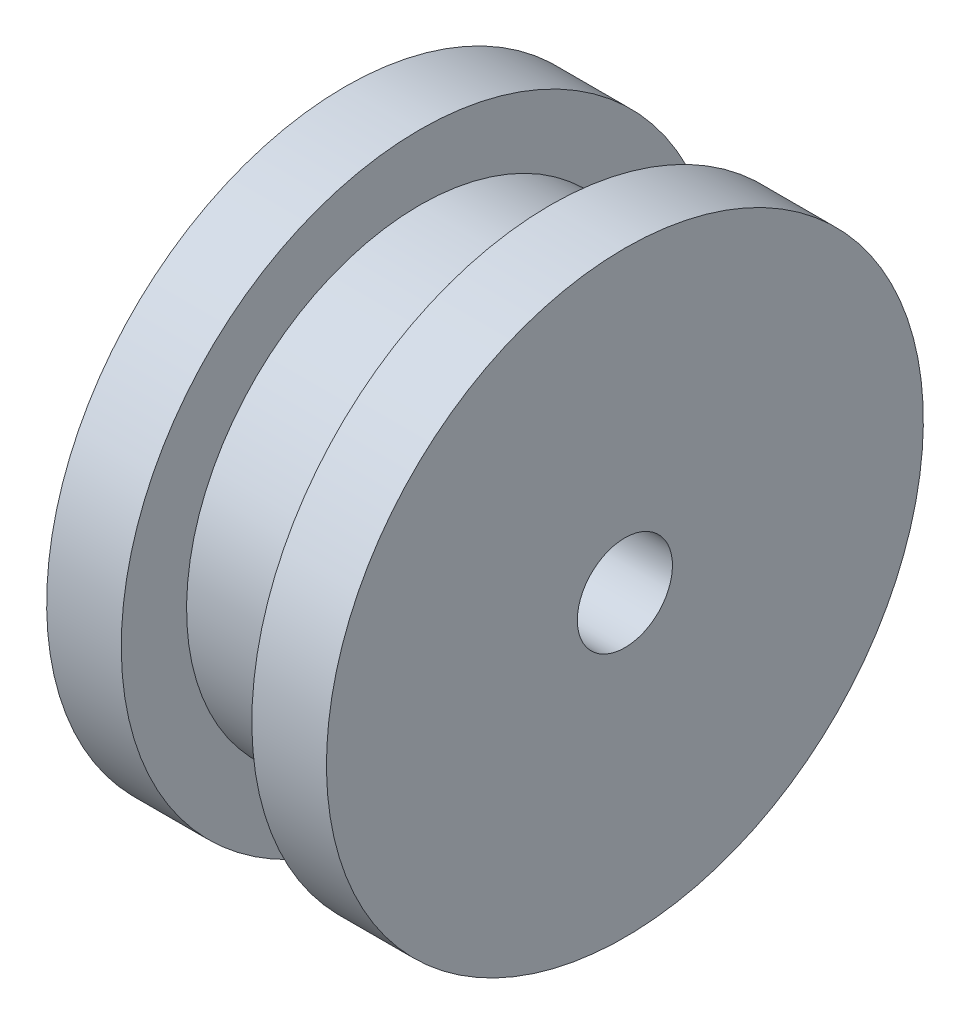
ISO-10303-21;
HEADER;
FILE_DESCRIPTION(('STEP AP214'),'2;1');
FILE_NAME('part.step','',(''),(''),'','','');
FILE_SCHEMA(('AUTOMOTIVE_DESIGN { 1 0 10303 214 1 1 1 1 }'));
ENDSEC;
DATA;
#1=APPLICATION_CONTEXT('core data for automotive mechanical design processes');
#2=APPLICATION_PROTOCOL_DEFINITION('international standard','automotive_design',2000,#1);
#3=PRODUCT_CONTEXT('',#1,'mechanical');
#4=PRODUCT('Part','Part','',(#3));
#5=PRODUCT_RELATED_PRODUCT_CATEGORY('part','',(#4));
#6=PRODUCT_DEFINITION_FORMATION('','',#4);
#7=PRODUCT_DEFINITION_CONTEXT('part definition',#1,'design');
#8=PRODUCT_DEFINITION('design','',#6,#7);
#9=PRODUCT_DEFINITION_SHAPE('','',#8);
#10=(LENGTH_UNIT() NAMED_UNIT(*) SI_UNIT(.MILLI.,.METRE.));
#11=(NAMED_UNIT(*) PLANE_ANGLE_UNIT() SI_UNIT($,.RADIAN.));
#12=(NAMED_UNIT(*) SI_UNIT($,.STERADIAN.) SOLID_ANGLE_UNIT());
#13=UNCERTAINTY_MEASURE_WITH_UNIT(LENGTH_MEASURE(1.E-05),#10,'distance_accuracy_value','');
#14=(GEOMETRIC_REPRESENTATION_CONTEXT(3) GLOBAL_UNCERTAINTY_ASSIGNED_CONTEXT((#13)) GLOBAL_UNIT_ASSIGNED_CONTEXT((#10,
#11,#12)) REPRESENTATION_CONTEXT('',''));
#15=CARTESIAN_POINT('',(0.,0.,0.));
#16=DIRECTION('',(0.,0.,1.));
#17=DIRECTION('',(1.,0.,0.));
#18=AXIS2_PLACEMENT_3D('',#15,#16,#17);
#19=CARTESIAN_POINT('',(0.,0.,0.));
#20=DIRECTION('',(-1.,0.,0.));
#21=DIRECTION('',(0.,-1.,0.));
#22=AXIS2_PLACEMENT_3D('',#19,#20,#21);
#23=PLANE('',#22);
#24=CARTESIAN_POINT('',(0.,0.,0.));
#25=DIRECTION('',(-1.,0.,0.));
#26=DIRECTION('',(0.,0.,1.));
#27=AXIS2_PLACEMENT_3D('',#24,#25,#26);
#28=CIRCLE('',#27,2.55);
#29=CARTESIAN_POINT('',(0.,0.,2.55));
#30=VERTEX_POINT('',#29);
#31=EDGE_CURVE('E64',#30,#30,#28,.T.);
#32=ORIENTED_EDGE('',*,*,#31,.F.);
#33=EDGE_LOOP('',(#32));
#34=FACE_BOUND('',#33,.T.);
#35=CARTESIAN_POINT('',(0.,0.,0.));
#36=DIRECTION('',(1.,0.,0.));
#37=DIRECTION('',(0.,1.,0.));
#38=AXIS2_PLACEMENT_3D('',#35,#36,#37);
#39=CIRCLE('',#38,16.);
#40=CARTESIAN_POINT('',(0.,16.,0.));
#41=VERTEX_POINT('',#40);
#42=EDGE_CURVE('E10',#41,#41,#39,.T.);
#43=ORIENTED_EDGE('',*,*,#42,.F.);
#44=EDGE_LOOP('',(#43));
#45=FACE_BOUND('',#44,.T.);
#46=ADVANCED_FACE('F36',(#34,#45),#23,.T.);
#47=CARTESIAN_POINT('',(15.,0.,0.));
#48=DIRECTION('',(1.,0.,0.));
#49=DIRECTION('',(0.,1.,0.));
#50=AXIS2_PLACEMENT_3D('',#47,#48,#49);
#51=CYLINDRICAL_SURFACE('',#50,16.);
#52=ORIENTED_EDGE('',*,*,#42,.T.);
#53=EDGE_LOOP('',(#52));
#54=FACE_BOUND('',#53,.T.);
#55=CARTESIAN_POINT('',(4.,0.,0.));
#56=DIRECTION('',(1.,0.,0.));
#57=DIRECTION('',(0.,1.,0.));
#58=AXIS2_PLACEMENT_3D('',#55,#56,#57);
#59=CIRCLE('',#58,16.);
#60=CARTESIAN_POINT('',(4.,16.,0.));
#61=VERTEX_POINT('',#60);
#62=EDGE_CURVE('E42',#61,#61,#59,.T.);
#63=ORIENTED_EDGE('',*,*,#62,.F.);
#64=EDGE_LOOP('',(#63));
#65=FACE_BOUND('',#64,.T.);
#66=ADVANCED_FACE('F73',(#54,#65),#51,.T.);
#67=CARTESIAN_POINT('',(4.,16.,0.));
#68=DIRECTION('',(1.,0.,0.));
#69=DIRECTION('',(0.,1.,0.));
#70=AXIS2_PLACEMENT_3D('',#67,#68,#69);
#71=PLANE('',#70);
#72=ORIENTED_EDGE('',*,*,#62,.T.);
#73=EDGE_LOOP('',(#72));
#74=FACE_BOUND('',#73,.T.);
#75=CARTESIAN_POINT('',(4.,0.,0.));
#76=DIRECTION('',(1.,0.,0.));
#77=DIRECTION('',(0.,1.,0.));
#78=AXIS2_PLACEMENT_3D('',#75,#76,#77);
#79=CIRCLE('',#78,12.5);
#80=CARTESIAN_POINT('',(4.,12.5,0.));
#81=VERTEX_POINT('',#80);
#82=EDGE_CURVE('E46',#81,#81,#79,.T.);
#83=ORIENTED_EDGE('',*,*,#82,.F.);
#84=EDGE_LOOP('',(#83));
#85=FACE_BOUND('',#84,.T.);
#86=ADVANCED_FACE('F77',(#74,#85),#71,.T.);
#87=CARTESIAN_POINT('',(15.,0.,0.));
#88=DIRECTION('',(1.,0.,0.));
#89=DIRECTION('',(0.,1.,0.));
#90=AXIS2_PLACEMENT_3D('',#87,#88,#89);
#91=CYLINDRICAL_SURFACE('',#90,12.5);
#92=ORIENTED_EDGE('',*,*,#82,.T.);
#93=EDGE_LOOP('',(#92));
#94=FACE_BOUND('',#93,.T.);
#95=CARTESIAN_POINT('',(11.,0.,0.));
#96=DIRECTION('',(1.,0.,0.));
#97=DIRECTION('',(0.,1.,0.));
#98=AXIS2_PLACEMENT_3D('',#95,#96,#97);
#99=CIRCLE('',#98,12.5);
#100=CARTESIAN_POINT('',(11.,12.5,0.));
#101=VERTEX_POINT('',#100);
#102=EDGE_CURVE('E50',#101,#101,#99,.T.);
#103=ORIENTED_EDGE('',*,*,#102,.F.);
#104=EDGE_LOOP('',(#103));
#105=FACE_BOUND('',#104,.T.);
#106=ADVANCED_FACE('F81',(#94,#105),#91,.T.);
#107=CARTESIAN_POINT('',(11.,12.5,0.));
#108=DIRECTION('',(-1.,0.,0.));
#109=DIRECTION('',(0.,-1.,0.));
#110=AXIS2_PLACEMENT_3D('',#107,#108,#109);
#111=PLANE('',#110);
#112=ORIENTED_EDGE('',*,*,#102,.T.);
#113=EDGE_LOOP('',(#112));
#114=FACE_BOUND('',#113,.T.);
#115=CARTESIAN_POINT('',(11.,0.,0.));
#116=DIRECTION('',(1.,0.,0.));
#117=DIRECTION('',(0.,1.,0.));
#118=AXIS2_PLACEMENT_3D('',#115,#116,#117);
#119=CIRCLE('',#118,16.);
#120=CARTESIAN_POINT('',(11.,16.,0.));
#121=VERTEX_POINT('',#120);
#122=EDGE_CURVE('E55',#121,#121,#119,.T.);
#123=ORIENTED_EDGE('',*,*,#122,.F.);
#124=EDGE_LOOP('',(#123));
#125=FACE_BOUND('',#124,.T.);
#126=ADVANCED_FACE('F87',(#114,#125),#111,.T.);
#127=CARTESIAN_POINT('',(15.,0.,0.));
#128=DIRECTION('',(1.,0.,0.));
#129=DIRECTION('',(0.,1.,0.));
#130=AXIS2_PLACEMENT_3D('',#127,#128,#129);
#131=CYLINDRICAL_SURFACE('',#130,16.);
#132=ORIENTED_EDGE('',*,*,#122,.T.);
#133=EDGE_LOOP('',(#132));
#134=FACE_BOUND('',#133,.T.);
#135=CARTESIAN_POINT('',(15.,0.,0.));
#136=DIRECTION('',(1.,0.,0.));
#137=DIRECTION('',(0.,1.,0.));
#138=AXIS2_PLACEMENT_3D('',#135,#136,#137);
#139=CIRCLE('',#138,16.);
#140=CARTESIAN_POINT('',(15.,16.,0.));
#141=VERTEX_POINT('',#140);
#142=EDGE_CURVE('E58',#141,#141,#139,.T.);
#143=ORIENTED_EDGE('',*,*,#142,.F.);
#144=EDGE_LOOP('',(#143));
#145=FACE_BOUND('',#144,.T.);
#146=ADVANCED_FACE('F91',(#134,#145),#131,.T.);
#147=CARTESIAN_POINT('',(15.,16.,0.));
#148=DIRECTION('',(1.,0.,0.));
#149=DIRECTION('',(0.,1.,0.));
#150=AXIS2_PLACEMENT_3D('',#147,#148,#149);
#151=PLANE('',#150);
#152=CARTESIAN_POINT('',(15.,0.,0.));
#153=DIRECTION('',(1.,0.,0.));
#154=DIRECTION('',(0.,1.,0.));
#155=AXIS2_PLACEMENT_3D('',#152,#153,#154);
#156=CIRCLE('',#155,2.55);
#157=CARTESIAN_POINT('',(15.,2.55,0.));
#158=VERTEX_POINT('',#157);
#159=EDGE_CURVE('E61',#158,#158,#156,.F.);
#160=ORIENTED_EDGE('',*,*,#159,.T.);
#161=EDGE_LOOP('',(#160));
#162=FACE_BOUND('',#161,.T.);
#163=ORIENTED_EDGE('',*,*,#142,.T.);
#164=EDGE_LOOP('',(#163));
#165=FACE_BOUND('',#164,.T.);
#166=ADVANCED_FACE('F95',(#162,#165),#151,.T.);
#167=CARTESIAN_POINT('',(22.2124891681028,0.,0.));
#168=DIRECTION('',(-1.,0.,0.));
#169=DIRECTION('',(0.,0.,1.));
#170=AXIS2_PLACEMENT_3D('',#167,#168,#169);
#171=CYLINDRICAL_SURFACE('',#170,2.55);
#172=ORIENTED_EDGE('',*,*,#31,.T.);
#173=EDGE_LOOP('',(#172));
#174=FACE_BOUND('',#173,.T.);
#175=ORIENTED_EDGE('',*,*,#159,.F.);
#176=EDGE_LOOP('',(#175));
#177=FACE_BOUND('',#176,.T.);
#178=ADVANCED_FACE('F68',(#174,#177),#171,.F.);
#179=CLOSED_SHELL('',(#46,#66,#86,#106,#126,#146,#166,#178));
#180=MANIFOLD_SOLID_BREP('B2',#179);
#181=ADVANCED_BREP_SHAPE_REPRESENTATION('',(#18,#180),#14);
#182=SHAPE_DEFINITION_REPRESENTATION(#9,#181);
ENDSEC;
END-ISO-10303-21;
